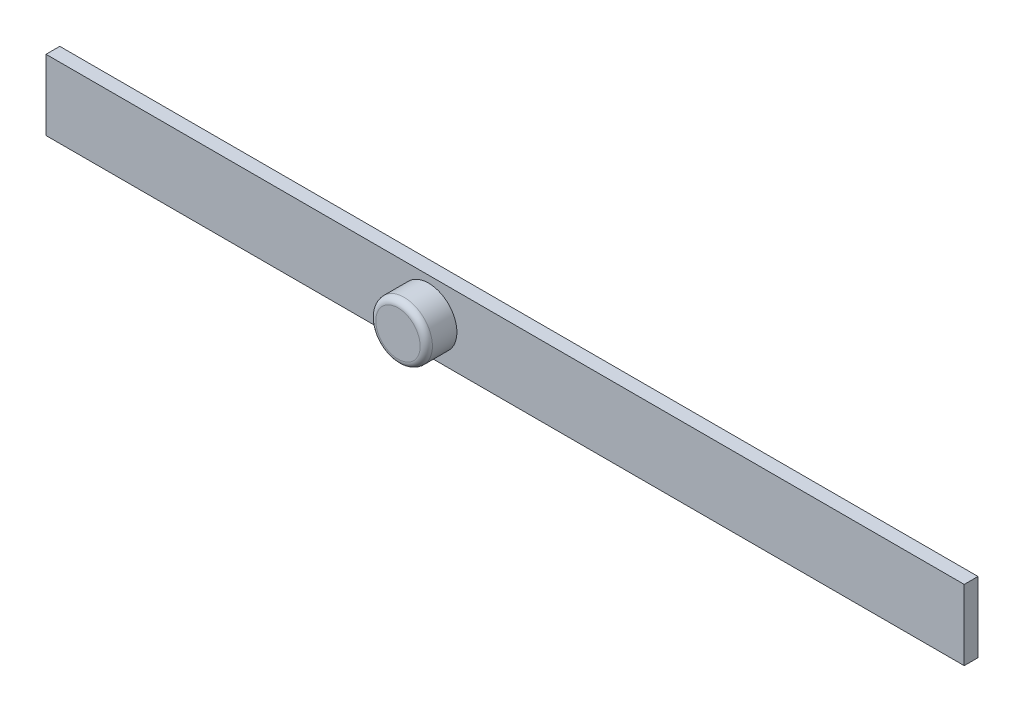
ISO-10303-21;
HEADER;
FILE_DESCRIPTION(('STEP AP214'),'2;1');
FILE_NAME('part.step','',(''),(''),'','','');
FILE_SCHEMA(('AUTOMOTIVE_DESIGN { 1 0 10303 214 1 1 1 1 }'));
ENDSEC;
DATA;
#1=APPLICATION_CONTEXT('core data for automotive mechanical design processes');
#2=APPLICATION_PROTOCOL_DEFINITION('international standard','automotive_design',2000,#1);
#3=PRODUCT_CONTEXT('',#1,'mechanical');
#4=PRODUCT('Part','Part','',(#3));
#5=PRODUCT_RELATED_PRODUCT_CATEGORY('part','',(#4));
#6=PRODUCT_DEFINITION_FORMATION('','',#4);
#7=PRODUCT_DEFINITION_CONTEXT('part definition',#1,'design');
#8=PRODUCT_DEFINITION('design','',#6,#7);
#9=PRODUCT_DEFINITION_SHAPE('','',#8);
#10=(LENGTH_UNIT() NAMED_UNIT(*) SI_UNIT(.MILLI.,.METRE.));
#11=(NAMED_UNIT(*) PLANE_ANGLE_UNIT() SI_UNIT($,.RADIAN.));
#12=(NAMED_UNIT(*) SI_UNIT($,.STERADIAN.) SOLID_ANGLE_UNIT());
#13=UNCERTAINTY_MEASURE_WITH_UNIT(LENGTH_MEASURE(1.E-05),#10,'distance_accuracy_value','');
#14=(GEOMETRIC_REPRESENTATION_CONTEXT(3) GLOBAL_UNCERTAINTY_ASSIGNED_CONTEXT((#13)) GLOBAL_UNIT_ASSIGNED_CONTEXT((#10,
#11,#12)) REPRESENTATION_CONTEXT('',''));
#15=CARTESIAN_POINT('',(0.,0.,0.));
#16=DIRECTION('',(0.,0.,1.));
#17=DIRECTION('',(1.,0.,0.));
#18=AXIS2_PLACEMENT_3D('',#15,#16,#17);
#19=CARTESIAN_POINT('',(30.,2.3,0.9));
#20=DIRECTION('',(-1.,0.,0.));
#21=DIRECTION('',(0.,-1.,0.));
#22=AXIS2_PLACEMENT_3D('',#19,#20,#21);
#23=PLANE('',#22);
#24=DIRECTION('',(0.,1.,0.));
#25=VECTOR('',#24,1.);
#26=CARTESIAN_POINT('',(30.,2.3,0.));
#27=LINE('',#26,#25);
#28=CARTESIAN_POINT('',(30.,-2.3,0.));
#29=VERTEX_POINT('',#28);
#30=CARTESIAN_POINT('',(30.,2.3,0.));
#31=VERTEX_POINT('',#30);
#32=EDGE_CURVE('E101',#29,#31,#27,.T.);
#33=ORIENTED_EDGE('',*,*,#32,.T.);
#34=DIRECTION('',(0.,0.,-1.));
#35=VECTOR('',#34,1.);
#36=CARTESIAN_POINT('',(30.,2.3,0.9));
#37=LINE('',#36,#35);
#38=CARTESIAN_POINT('',(30.,2.3,0.9));
#39=VERTEX_POINT('',#38);
#40=EDGE_CURVE('E92',#39,#31,#37,.T.);
#41=ORIENTED_EDGE('',*,*,#40,.F.);
#42=DIRECTION('',(0.,1.,0.));
#43=VECTOR('',#42,1.);
#44=CARTESIAN_POINT('',(30.,2.3,0.9));
#45=LINE('',#44,#43);
#46=CARTESIAN_POINT('',(30.,-2.3,0.9));
#47=VERTEX_POINT('',#46);
#48=EDGE_CURVE('E86',#47,#39,#45,.T.);
#49=ORIENTED_EDGE('',*,*,#48,.F.);
#50=DIRECTION('',(0.,0.,-1.));
#51=VECTOR('',#50,1.);
#52=CARTESIAN_POINT('',(30.,-2.3,0.9));
#53=LINE('',#52,#51);
#54=EDGE_CURVE('E97',#47,#29,#53,.T.);
#55=ORIENTED_EDGE('',*,*,#54,.T.);
#56=EDGE_LOOP('',(#33,#41,#49,#55));
#57=FACE_BOUND('',#56,.T.);
#58=ADVANCED_FACE('F33',(#57),#23,.F.);
#59=CARTESIAN_POINT('',(-30.,2.3,0.9));
#60=DIRECTION('',(0.,-1.,0.));
#61=DIRECTION('',(0.,0.,-1.));
#62=AXIS2_PLACEMENT_3D('',#59,#60,#61);
#63=PLANE('',#62);
#64=DIRECTION('',(-1.,0.,0.));
#65=VECTOR('',#64,1.);
#66=CARTESIAN_POINT('',(-30.,2.3,0.));
#67=LINE('',#66,#65);
#68=CARTESIAN_POINT('',(-30.,2.3,0.));
#69=VERTEX_POINT('',#68);
#70=EDGE_CURVE('E91',#31,#69,#67,.T.);
#71=ORIENTED_EDGE('',*,*,#70,.T.);
#72=DIRECTION('',(0.,0.,-1.));
#73=VECTOR('',#72,1.);
#74=CARTESIAN_POINT('',(-30.,2.3,0.9));
#75=LINE('',#74,#73);
#76=CARTESIAN_POINT('',(-30.,2.3,0.9));
#77=VERTEX_POINT('',#76);
#78=EDGE_CURVE('E89',#77,#69,#75,.T.);
#79=ORIENTED_EDGE('',*,*,#78,.F.);
#80=DIRECTION('',(-1.,0.,0.));
#81=VECTOR('',#80,1.);
#82=CARTESIAN_POINT('',(-30.,2.3,0.9));
#83=LINE('',#82,#81);
#84=EDGE_CURVE('E81',#39,#77,#83,.T.);
#85=ORIENTED_EDGE('',*,*,#84,.F.);
#86=ORIENTED_EDGE('',*,*,#40,.T.);
#87=EDGE_LOOP('',(#71,#79,#85,#86));
#88=FACE_BOUND('',#87,.T.);
#89=ADVANCED_FACE('F90',(#88),#63,.F.);
#90=CARTESIAN_POINT('',(-30.,2.3,0.9));
#91=DIRECTION('',(1.,0.,0.));
#92=DIRECTION('',(0.,1.,0.));
#93=AXIS2_PLACEMENT_3D('',#90,#91,#92);
#94=PLANE('',#93);
#95=DIRECTION('',(0.,-1.,0.));
#96=VECTOR('',#95,1.);
#97=CARTESIAN_POINT('',(-30.,2.3,0.));
#98=LINE('',#97,#96);
#99=CARTESIAN_POINT('',(-30.,-2.3,0.));
#100=VERTEX_POINT('',#99);
#101=EDGE_CURVE('E67',#69,#100,#98,.T.);
#102=ORIENTED_EDGE('',*,*,#101,.T.);
#103=DIRECTION('',(0.,0.,-1.));
#104=VECTOR('',#103,1.);
#105=CARTESIAN_POINT('',(-30.,-2.3,0.9));
#106=LINE('',#105,#104);
#107=CARTESIAN_POINT('',(-30.,-2.3,0.9));
#108=VERTEX_POINT('',#107);
#109=EDGE_CURVE('E93',#108,#100,#106,.T.);
#110=ORIENTED_EDGE('',*,*,#109,.F.);
#111=DIRECTION('',(0.,-1.,0.));
#112=VECTOR('',#111,1.);
#113=CARTESIAN_POINT('',(-30.,2.3,0.9));
#114=LINE('',#113,#112);
#115=EDGE_CURVE('E84',#77,#108,#114,.T.);
#116=ORIENTED_EDGE('',*,*,#115,.F.);
#117=ORIENTED_EDGE('',*,*,#78,.T.);
#118=EDGE_LOOP('',(#102,#110,#116,#117));
#119=FACE_BOUND('',#118,.T.);
#120=ADVANCED_FACE('F95',(#119),#94,.F.);
#121=CARTESIAN_POINT('',(-30.,-2.3,0.9));
#122=DIRECTION('',(0.,1.,0.));
#123=DIRECTION('',(0.,0.,1.));
#124=AXIS2_PLACEMENT_3D('',#121,#122,#123);
#125=PLANE('',#124);
#126=DIRECTION('',(1.,0.,0.));
#127=VECTOR('',#126,1.);
#128=CARTESIAN_POINT('',(-30.,-2.3,0.));
#129=LINE('',#128,#127);
#130=EDGE_CURVE('E73',#100,#29,#129,.T.);
#131=ORIENTED_EDGE('',*,*,#130,.T.);
#132=ORIENTED_EDGE('',*,*,#54,.F.);
#133=DIRECTION('',(1.,0.,0.));
#134=VECTOR('',#133,1.);
#135=CARTESIAN_POINT('',(-30.,-2.3,0.9));
#136=LINE('',#135,#134);
#137=EDGE_CURVE('E50',#108,#47,#136,.T.);
#138=ORIENTED_EDGE('',*,*,#137,.F.);
#139=ORIENTED_EDGE('',*,*,#109,.T.);
#140=EDGE_LOOP('',(#131,#132,#138,#139));
#141=FACE_BOUND('',#140,.T.);
#142=ADVANCED_FACE('F132',(#141),#125,.F.);
#143=CARTESIAN_POINT('',(0.,0.,0.9));
#144=DIRECTION('',(0.,0.,1.));
#145=DIRECTION('',(1.,0.,0.));
#146=AXIS2_PLACEMENT_3D('',#143,#144,#145);
#147=PLANE('',#146);
#148=CARTESIAN_POINT('',(-5.,0.,0.9));
#149=DIRECTION('',(0.,0.,1.));
#150=DIRECTION('',(1.,0.,0.));
#151=AXIS2_PLACEMENT_3D('',#148,#149,#150);
#152=CIRCLE('',#151,1.85);
#153=CARTESIAN_POINT('',(-3.15,0.,0.9));
#154=VERTEX_POINT('',#153);
#155=EDGE_CURVE('E104',#154,#154,#152,.T.);
#156=ORIENTED_EDGE('',*,*,#155,.F.);
#157=EDGE_LOOP('',(#156));
#158=FACE_BOUND('',#157,.T.);
#159=ORIENTED_EDGE('',*,*,#48,.T.);
#160=ORIENTED_EDGE('',*,*,#84,.T.);
#161=ORIENTED_EDGE('',*,*,#115,.T.);
#162=ORIENTED_EDGE('',*,*,#137,.T.);
#163=EDGE_LOOP('',(#159,#160,#161,#162));
#164=FACE_BOUND('',#163,.T.);
#165=ADVANCED_FACE('F82',(#158,#164),#147,.T.);
#166=CARTESIAN_POINT('',(0.,0.,0.));
#167=DIRECTION('',(0.,0.,1.));
#168=DIRECTION('',(1.,0.,0.));
#169=AXIS2_PLACEMENT_3D('',#166,#167,#168);
#170=PLANE('',#169);
#171=ORIENTED_EDGE('',*,*,#32,.F.);
#172=ORIENTED_EDGE('',*,*,#130,.F.);
#173=ORIENTED_EDGE('',*,*,#101,.F.);
#174=ORIENTED_EDGE('',*,*,#70,.F.);
#175=EDGE_LOOP('',(#171,#172,#173,#174));
#176=FACE_BOUND('',#175,.T.);
#177=ADVANCED_FACE('F135',(#176),#170,.F.);
#178=CARTESIAN_POINT('',(-5.,0.,2.9));
#179=DIRECTION('',(0.,0.,-1.));
#180=DIRECTION('',(-1.,0.,0.));
#181=AXIS2_PLACEMENT_3D('',#178,#179,#180);
#182=CYLINDRICAL_SURFACE('',#181,1.85);
#183=CARTESIAN_POINT('',(-5.,0.,2.5));
#184=DIRECTION('',(0.,0.,1.));
#185=DIRECTION('',(1.,0.,0.));
#186=AXIS2_PLACEMENT_3D('',#183,#184,#185);
#187=CIRCLE('',#186,1.85);
#188=CARTESIAN_POINT('',(-3.15,0.,2.5));
#189=VERTEX_POINT('',#188);
#190=EDGE_CURVE('E11',#189,#189,#187,.F.);
#191=ORIENTED_EDGE('',*,*,#190,.T.);
#192=EDGE_LOOP('',(#191));
#193=FACE_BOUND('',#192,.T.);
#194=ORIENTED_EDGE('',*,*,#155,.T.);
#195=EDGE_LOOP('',(#194));
#196=FACE_BOUND('',#195,.T.);
#197=ADVANCED_FACE('F120',(#193,#196),#182,.T.);
#198=CARTESIAN_POINT('',(-5.,0.,2.9));
#199=DIRECTION('',(0.,0.,1.));
#200=DIRECTION('',(1.,0.,0.));
#201=AXIS2_PLACEMENT_3D('',#198,#199,#200);
#202=PLANE('',#201);
#203=CARTESIAN_POINT('',(-5.,0.,2.9));
#204=DIRECTION('',(0.,0.,1.));
#205=DIRECTION('',(1.,0.,0.));
#206=AXIS2_PLACEMENT_3D('',#203,#204,#205);
#207=CIRCLE('',#206,1.45);
#208=CARTESIAN_POINT('',(-3.55,0.,2.9));
#209=VERTEX_POINT('',#208);
#210=EDGE_CURVE('E42',#209,#209,#207,.T.);
#211=ORIENTED_EDGE('',*,*,#210,.T.);
#212=EDGE_LOOP('',(#211));
#213=FACE_BOUND('',#212,.T.);
#214=ADVANCED_FACE('F113',(#213),#202,.T.);
#215=CARTESIAN_POINT('',(-5.,0.,2.5));
#216=DIRECTION('',(0.,0.,1.));
#217=DIRECTION('',(1.,0.,0.));
#218=AXIS2_PLACEMENT_3D('',#215,#216,#217);
#219=TOROIDAL_SURFACE('',#218,1.45,0.4);
#220=ORIENTED_EDGE('',*,*,#190,.F.);
#221=EDGE_LOOP('',(#220));
#222=FACE_BOUND('',#221,.T.);
#223=ORIENTED_EDGE('',*,*,#210,.F.);
#224=EDGE_LOOP('',(#223));
#225=FACE_BOUND('',#224,.T.);
#226=ADVANCED_FACE('F35',(#222,#225),#219,.T.);
#227=CLOSED_SHELL('',(#58,#89,#120,#142,#165,#177,#197,#214,#226));
#228=MANIFOLD_SOLID_BREP('B2',#227);
#229=ADVANCED_BREP_SHAPE_REPRESENTATION('',(#18,#228),#14);
#230=SHAPE_DEFINITION_REPRESENTATION(#9,#229);
ENDSEC;
END-ISO-10303-21;
